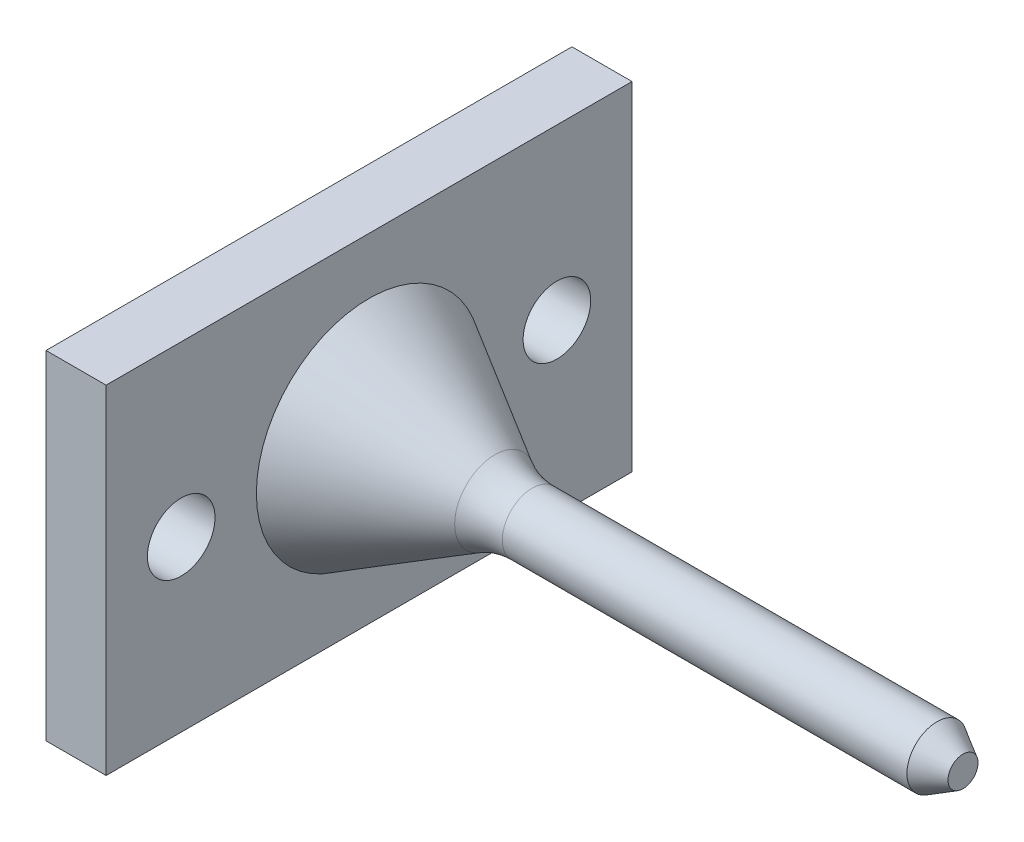
ISO-10303-21;
HEADER;
FILE_DESCRIPTION(('STEP AP214'),'2;1');
FILE_NAME('part.step','',(''),(''),'','','');
FILE_SCHEMA(('AUTOMOTIVE_DESIGN { 1 0 10303 214 1 1 1 1 }'));
ENDSEC;
DATA;
#1=APPLICATION_CONTEXT('core data for automotive mechanical design processes');
#2=APPLICATION_PROTOCOL_DEFINITION('international standard','automotive_design',2000,#1);
#3=PRODUCT_CONTEXT('',#1,'mechanical');
#4=PRODUCT('Part','Part','',(#3));
#5=PRODUCT_RELATED_PRODUCT_CATEGORY('part','',(#4));
#6=PRODUCT_DEFINITION_FORMATION('','',#4);
#7=PRODUCT_DEFINITION_CONTEXT('part definition',#1,'design');
#8=PRODUCT_DEFINITION('design','',#6,#7);
#9=PRODUCT_DEFINITION_SHAPE('','',#8);
#10=(LENGTH_UNIT() NAMED_UNIT(*) SI_UNIT(.MILLI.,.METRE.));
#11=(NAMED_UNIT(*) PLANE_ANGLE_UNIT() SI_UNIT($,.RADIAN.));
#12=(NAMED_UNIT(*) SI_UNIT($,.STERADIAN.) SOLID_ANGLE_UNIT());
#13=UNCERTAINTY_MEASURE_WITH_UNIT(LENGTH_MEASURE(1.E-05),#10,'distance_accuracy_value','');
#14=(GEOMETRIC_REPRESENTATION_CONTEXT(3) GLOBAL_UNCERTAINTY_ASSIGNED_CONTEXT((#13)) GLOBAL_UNIT_ASSIGNED_CONTEXT((#10,
#11,#12)) REPRESENTATION_CONTEXT('',''));
#15=CARTESIAN_POINT('',(0.,0.,0.));
#16=DIRECTION('',(0.,0.,1.));
#17=DIRECTION('',(1.,0.,0.));
#18=AXIS2_PLACEMENT_3D('',#15,#16,#17);
#19=CARTESIAN_POINT('',(16.7320508075687,0.,0.));
#20=DIRECTION('',(-1.,0.,0.));
#21=DIRECTION('',(0.,0.,1.));
#22=AXIS2_PLACEMENT_3D('',#19,#20,#21);
#23=CONICAL_SURFACE('',#22,5.33974596215563,0.523598775598303);
#24=CARTESIAN_POINT('',(0.,0.,0.));
#25=DIRECTION('',(-1.,0.,0.));
#26=DIRECTION('',(0.,0.,1.));
#27=AXIS2_PLACEMENT_3D('',#24,#25,#26);
#28=CIRCLE('',#27,15.);
#29=CARTESIAN_POINT('',(0.,0.,15.));
#30=VERTEX_POINT('',#29);
#31=EDGE_CURVE('E138',#30,#30,#28,.T.);
#32=ORIENTED_EDGE('',*,*,#31,.F.);
#33=EDGE_LOOP('',(#32));
#34=FACE_BOUND('',#33,.T.);
#35=CARTESIAN_POINT('',(16.7320508075687,0.,0.));
#36=DIRECTION('',(-1.,0.,0.));
#37=DIRECTION('',(0.,0.,1.));
#38=AXIS2_PLACEMENT_3D('',#35,#36,#37);
#39=CIRCLE('',#38,5.33974596215563);
#40=CARTESIAN_POINT('',(16.7320508075687,0.,5.33974596215563));
#41=VERTEX_POINT('',#40);
#42=EDGE_CURVE('E134',#41,#41,#39,.T.);
#43=ORIENTED_EDGE('',*,*,#42,.T.);
#44=EDGE_LOOP('',(#43));
#45=FACE_BOUND('',#44,.T.);
#46=ADVANCED_FACE('F39',(#34,#45),#23,.T.);
#47=CARTESIAN_POINT('',(21.7320508075687,0.,0.));
#48=DIRECTION('',(-1.,0.,0.));
#49=DIRECTION('',(0.,0.,1.));
#50=AXIS2_PLACEMENT_3D('',#47,#48,#49);
#51=TOROIDAL_SURFACE('',#50,14.,10.);
#52=ORIENTED_EDGE('',*,*,#42,.F.);
#53=EDGE_LOOP('',(#52));
#54=FACE_BOUND('',#53,.T.);
#55=CARTESIAN_POINT('',(21.7320508075687,0.,0.));
#56=DIRECTION('',(-1.,0.,0.));
#57=DIRECTION('',(0.,0.,1.));
#58=AXIS2_PLACEMENT_3D('',#55,#56,#57);
#59=CIRCLE('',#58,3.99999999999999);
#60=CARTESIAN_POINT('',(21.7320508075687,0.,3.99999999999999));
#61=VERTEX_POINT('',#60);
#62=EDGE_CURVE('E130',#61,#61,#59,.T.);
#63=ORIENTED_EDGE('',*,*,#62,.T.);
#64=EDGE_LOOP('',(#63));
#65=FACE_BOUND('',#64,.T.);
#66=ADVANCED_FACE('F162',(#54,#65),#51,.F.);
#67=CARTESIAN_POINT('',(0.,0.,0.));
#68=DIRECTION('',(-1.,0.,0.));
#69=DIRECTION('',(0.,0.,1.));
#70=AXIS2_PLACEMENT_3D('',#67,#68,#69);
#71=CYLINDRICAL_SURFACE('',#70,4.);
#72=CARTESIAN_POINT('',(75.5884572681197,0.,0.));
#73=DIRECTION('',(-1.,0.,0.));
#74=DIRECTION('',(0.,0.,1.));
#75=AXIS2_PLACEMENT_3D('',#72,#73,#74);
#76=CIRCLE('',#75,4.);
#77=CARTESIAN_POINT('',(75.5884572681197,0.,4.));
#78=VERTEX_POINT('',#77);
#79=EDGE_CURVE('E49',#78,#78,#76,.T.);
#80=ORIENTED_EDGE('',*,*,#79,.T.);
#81=EDGE_LOOP('',(#80));
#82=FACE_BOUND('',#81,.T.);
#83=ORIENTED_EDGE('',*,*,#62,.F.);
#84=EDGE_LOOP('',(#83));
#85=FACE_BOUND('',#84,.T.);
#86=ADVANCED_FACE('F145',(#82,#85),#71,.T.);
#87=CARTESIAN_POINT('',(79.0525588832575,0.,0.));
#88=DIRECTION('',(-1.,0.,0.));
#89=DIRECTION('',(0.,0.,1.));
#90=AXIS2_PLACEMENT_3D('',#87,#88,#89);
#91=PLANE('',#90);
#92=CARTESIAN_POINT('',(79.0525588832575,0.,0.));
#93=DIRECTION('',(-1.,0.,0.));
#94=DIRECTION('',(0.,0.,1.));
#95=AXIS2_PLACEMENT_3D('',#92,#93,#94);
#96=CIRCLE('',#95,1.99999999999999);
#97=CARTESIAN_POINT('',(79.0525588832575,0.,1.99999999999999));
#98=VERTEX_POINT('',#97);
#99=EDGE_CURVE('E11',#98,#98,#96,.F.);
#100=ORIENTED_EDGE('',*,*,#99,.T.);
#101=EDGE_LOOP('',(#100));
#102=FACE_BOUND('',#101,.T.);
#103=ADVANCED_FACE('F149',(#102),#91,.F.);
#104=CARTESIAN_POINT('',(75.5884572681197,0.,0.));
#105=DIRECTION('',(-1.,0.,0.));
#106=DIRECTION('',(0.,0.,1.));
#107=AXIS2_PLACEMENT_3D('',#104,#105,#106);
#108=CONICAL_SURFACE('',#107,4.,0.523598775598302);
#109=ORIENTED_EDGE('',*,*,#99,.F.);
#110=EDGE_LOOP('',(#109));
#111=FACE_BOUND('',#110,.T.);
#112=ORIENTED_EDGE('',*,*,#79,.F.);
#113=EDGE_LOOP('',(#112));
#114=FACE_BOUND('',#113,.T.);
#115=ADVANCED_FACE('F41',(#111,#114),#108,.T.);
#116=CARTESIAN_POINT('',(-8.,0.,0.));
#117=DIRECTION('',(-1.,0.,0.));
#118=DIRECTION('',(0.,0.,1.));
#119=AXIS2_PLACEMENT_3D('',#116,#117,#118);
#120=PLANE('',#119);
#121=CARTESIAN_POINT('',(-8.,0.,-25.));
#122=DIRECTION('',(-1.,0.,0.));
#123=DIRECTION('',(0.,0.,1.));
#124=AXIS2_PLACEMENT_3D('',#121,#122,#123);
#125=CIRCLE('',#124,4.5);
#126=CARTESIAN_POINT('',(-8.,0.,-20.5));
#127=VERTEX_POINT('',#126);
#128=EDGE_CURVE('E117',#127,#127,#125,.T.);
#129=ORIENTED_EDGE('',*,*,#128,.F.);
#130=EDGE_LOOP('',(#129));
#131=FACE_BOUND('',#130,.T.);
#132=DIRECTION('',(0.,-1.,0.));
#133=VECTOR('',#132,1.);
#134=CARTESIAN_POINT('',(-8.,22.5,-35.));
#135=LINE('',#134,#133);
#136=CARTESIAN_POINT('',(-8.,22.5,-35.));
#137=VERTEX_POINT('',#136);
#138=CARTESIAN_POINT('',(-8.,-22.5,-35.));
#139=VERTEX_POINT('',#138);
#140=EDGE_CURVE('E94',#137,#139,#135,.T.);
#141=ORIENTED_EDGE('',*,*,#140,.T.);
#142=DIRECTION('',(0.,0.,1.));
#143=VECTOR('',#142,1.);
#144=CARTESIAN_POINT('',(-8.,-22.5,-35.));
#145=LINE('',#144,#143);
#146=CARTESIAN_POINT('',(-8.,-22.5,35.));
#147=VERTEX_POINT('',#146);
#148=EDGE_CURVE('E88',#139,#147,#145,.T.);
#149=ORIENTED_EDGE('',*,*,#148,.T.);
#150=DIRECTION('',(0.,1.,0.));
#151=VECTOR('',#150,1.);
#152=CARTESIAN_POINT('',(-8.,22.5,35.));
#153=LINE('',#152,#151);
#154=CARTESIAN_POINT('',(-8.,22.5,35.));
#155=VERTEX_POINT('',#154);
#156=EDGE_CURVE('E92',#147,#155,#153,.T.);
#157=ORIENTED_EDGE('',*,*,#156,.T.);
#158=DIRECTION('',(0.,0.,-1.));
#159=VECTOR('',#158,1.);
#160=CARTESIAN_POINT('',(-8.,22.5,-35.));
#161=LINE('',#160,#159);
#162=EDGE_CURVE('E57',#155,#137,#161,.T.);
#163=ORIENTED_EDGE('',*,*,#162,.T.);
#164=EDGE_LOOP('',(#141,#149,#157,#163));
#165=FACE_BOUND('',#164,.T.);
#166=CARTESIAN_POINT('',(-8.,0.,25.));
#167=DIRECTION('',(-1.,0.,0.));
#168=DIRECTION('',(0.,0.,1.));
#169=AXIS2_PLACEMENT_3D('',#166,#167,#168);
#170=CIRCLE('',#169,4.5);
#171=CARTESIAN_POINT('',(-8.,0.,29.5));
#172=VERTEX_POINT('',#171);
#173=EDGE_CURVE('E200',#172,#172,#170,.T.);
#174=ORIENTED_EDGE('',*,*,#173,.F.);
#175=EDGE_LOOP('',(#174));
#176=FACE_BOUND('',#175,.T.);
#177=ADVANCED_FACE('F89',(#131,#165,#176),#120,.T.);
#178=CARTESIAN_POINT('',(0.,0.,0.));
#179=DIRECTION('',(-1.,0.,0.));
#180=DIRECTION('',(0.,0.,1.));
#181=AXIS2_PLACEMENT_3D('',#178,#179,#180);
#182=PLANE('',#181);
#183=ORIENTED_EDGE('',*,*,#31,.T.);
#184=EDGE_LOOP('',(#183));
#185=FACE_BOUND('',#184,.T.);
#186=DIRECTION('',(0.,-1.,0.));
#187=VECTOR('',#186,1.);
#188=CARTESIAN_POINT('',(0.,22.5,-35.));
#189=LINE('',#188,#187);
#190=CARTESIAN_POINT('',(0.,22.5,-35.));
#191=VERTEX_POINT('',#190);
#192=CARTESIAN_POINT('',(0.,-22.5,-35.));
#193=VERTEX_POINT('',#192);
#194=EDGE_CURVE('E113',#191,#193,#189,.T.);
#195=ORIENTED_EDGE('',*,*,#194,.F.);
#196=DIRECTION('',(0.,0.,-1.));
#197=VECTOR('',#196,1.);
#198=CARTESIAN_POINT('',(0.,22.5,-35.));
#199=LINE('',#198,#197);
#200=CARTESIAN_POINT('',(0.,22.5,35.));
#201=VERTEX_POINT('',#200);
#202=EDGE_CURVE('E80',#201,#191,#199,.T.);
#203=ORIENTED_EDGE('',*,*,#202,.F.);
#204=DIRECTION('',(0.,1.,0.));
#205=VECTOR('',#204,1.);
#206=CARTESIAN_POINT('',(0.,22.5,35.));
#207=LINE('',#206,#205);
#208=CARTESIAN_POINT('',(0.,-22.5,35.));
#209=VERTEX_POINT('',#208);
#210=EDGE_CURVE('E74',#209,#201,#207,.T.);
#211=ORIENTED_EDGE('',*,*,#210,.F.);
#212=DIRECTION('',(0.,0.,1.));
#213=VECTOR('',#212,1.);
#214=CARTESIAN_POINT('',(0.,-22.5,-35.));
#215=LINE('',#214,#213);
#216=EDGE_CURVE('E100',#193,#209,#215,.T.);
#217=ORIENTED_EDGE('',*,*,#216,.F.);
#218=EDGE_LOOP('',(#195,#203,#211,#217));
#219=FACE_BOUND('',#218,.T.);
#220=CARTESIAN_POINT('',(0.,0.,-25.));
#221=DIRECTION('',(-1.,0.,0.));
#222=DIRECTION('',(0.,0.,1.));
#223=AXIS2_PLACEMENT_3D('',#220,#221,#222);
#224=CIRCLE('',#223,4.5);
#225=CARTESIAN_POINT('',(0.,0.,-20.5));
#226=VERTEX_POINT('',#225);
#227=EDGE_CURVE('E208',#226,#226,#224,.T.);
#228=ORIENTED_EDGE('',*,*,#227,.T.);
#229=EDGE_LOOP('',(#228));
#230=FACE_BOUND('',#229,.T.);
#231=CARTESIAN_POINT('',(0.,0.,25.));
#232=DIRECTION('',(-1.,0.,0.));
#233=DIRECTION('',(0.,0.,1.));
#234=AXIS2_PLACEMENT_3D('',#231,#232,#233);
#235=CIRCLE('',#234,4.5);
#236=CARTESIAN_POINT('',(0.,0.,29.5));
#237=VERTEX_POINT('',#236);
#238=EDGE_CURVE('E203',#237,#237,#235,.T.);
#239=ORIENTED_EDGE('',*,*,#238,.T.);
#240=EDGE_LOOP('',(#239));
#241=FACE_BOUND('',#240,.T.);
#242=ADVANCED_FACE('F155',(#185,#219,#230,#241),#182,.F.);
#243=CARTESIAN_POINT('',(-8.,22.5,-35.));
#244=DIRECTION('',(0.,0.,1.));
#245=DIRECTION('',(1.,0.,0.));
#246=AXIS2_PLACEMENT_3D('',#243,#244,#245);
#247=PLANE('',#246);
#248=ORIENTED_EDGE('',*,*,#194,.T.);
#249=DIRECTION('',(1.,0.,0.));
#250=VECTOR('',#249,1.);
#251=CARTESIAN_POINT('',(-8.,-22.5,-35.));
#252=LINE('',#251,#250);
#253=EDGE_CURVE('E102',#139,#193,#252,.T.);
#254=ORIENTED_EDGE('',*,*,#253,.F.);
#255=ORIENTED_EDGE('',*,*,#140,.F.);
#256=DIRECTION('',(1.,0.,0.));
#257=VECTOR('',#256,1.);
#258=CARTESIAN_POINT('',(-8.,22.5,-35.));
#259=LINE('',#258,#257);
#260=EDGE_CURVE('E109',#137,#191,#259,.T.);
#261=ORIENTED_EDGE('',*,*,#260,.T.);
#262=EDGE_LOOP('',(#248,#254,#255,#261));
#263=FACE_BOUND('',#262,.T.);
#264=ADVANCED_FACE('F174',(#263),#247,.F.);
#265=CARTESIAN_POINT('',(-8.,-22.5,-35.));
#266=DIRECTION('',(0.,1.,0.));
#267=DIRECTION('',(0.,0.,1.));
#268=AXIS2_PLACEMENT_3D('',#265,#266,#267);
#269=PLANE('',#268);
#270=ORIENTED_EDGE('',*,*,#216,.T.);
#271=DIRECTION('',(1.,0.,0.));
#272=VECTOR('',#271,1.);
#273=CARTESIAN_POINT('',(-8.,-22.5,35.));
#274=LINE('',#273,#272);
#275=EDGE_CURVE('E98',#147,#209,#274,.T.);
#276=ORIENTED_EDGE('',*,*,#275,.F.);
#277=ORIENTED_EDGE('',*,*,#148,.F.);
#278=ORIENTED_EDGE('',*,*,#253,.T.);
#279=EDGE_LOOP('',(#270,#276,#277,#278));
#280=FACE_BOUND('',#279,.T.);
#281=ADVANCED_FACE('F99',(#280),#269,.F.);
#282=CARTESIAN_POINT('',(-8.,22.5,35.));
#283=DIRECTION('',(0.,0.,-1.));
#284=DIRECTION('',(-1.,0.,0.));
#285=AXIS2_PLACEMENT_3D('',#282,#283,#284);
#286=PLANE('',#285);
#287=ORIENTED_EDGE('',*,*,#210,.T.);
#288=DIRECTION('',(1.,0.,0.));
#289=VECTOR('',#288,1.);
#290=CARTESIAN_POINT('',(-8.,22.5,35.));
#291=LINE('',#290,#289);
#292=EDGE_CURVE('E103',#155,#201,#291,.T.);
#293=ORIENTED_EDGE('',*,*,#292,.F.);
#294=ORIENTED_EDGE('',*,*,#156,.F.);
#295=ORIENTED_EDGE('',*,*,#275,.T.);
#296=EDGE_LOOP('',(#287,#293,#294,#295));
#297=FACE_BOUND('',#296,.T.);
#298=ADVANCED_FACE('F105',(#297),#286,.F.);
#299=CARTESIAN_POINT('',(-8.,22.5,-35.));
#300=DIRECTION('',(0.,-1.,0.));
#301=DIRECTION('',(0.,0.,-1.));
#302=AXIS2_PLACEMENT_3D('',#299,#300,#301);
#303=PLANE('',#302);
#304=ORIENTED_EDGE('',*,*,#202,.T.);
#305=ORIENTED_EDGE('',*,*,#260,.F.);
#306=ORIENTED_EDGE('',*,*,#162,.F.);
#307=ORIENTED_EDGE('',*,*,#292,.T.);
#308=EDGE_LOOP('',(#304,#305,#306,#307));
#309=FACE_BOUND('',#308,.T.);
#310=ADVANCED_FACE('F182',(#309),#303,.F.);
#311=CARTESIAN_POINT('',(-8.,0.,-25.));
#312=DIRECTION('',(1.,0.,0.));
#313=DIRECTION('',(0.,0.,-1.));
#314=AXIS2_PLACEMENT_3D('',#311,#312,#313);
#315=CYLINDRICAL_SURFACE('',#314,4.5);
#316=ORIENTED_EDGE('',*,*,#128,.T.);
#317=EDGE_LOOP('',(#316));
#318=FACE_BOUND('',#317,.T.);
#319=ORIENTED_EDGE('',*,*,#227,.F.);
#320=EDGE_LOOP('',(#319));
#321=FACE_BOUND('',#320,.T.);
#322=ADVANCED_FACE('F185',(#318,#321),#315,.F.);
#323=CARTESIAN_POINT('',(-8.,0.,25.));
#324=DIRECTION('',(1.,0.,0.));
#325=DIRECTION('',(0.,0.,-1.));
#326=AXIS2_PLACEMENT_3D('',#323,#324,#325);
#327=CYLINDRICAL_SURFACE('',#326,4.5);
#328=ORIENTED_EDGE('',*,*,#173,.T.);
#329=EDGE_LOOP('',(#328));
#330=FACE_BOUND('',#329,.T.);
#331=ORIENTED_EDGE('',*,*,#238,.F.);
#332=EDGE_LOOP('',(#331));
#333=FACE_BOUND('',#332,.T.);
#334=ADVANCED_FACE('F191',(#330,#333),#327,.F.);
#335=CLOSED_SHELL('',(#46,#66,#86,#103,#115,#177,#242,#264,#281,#298,#310,#322,#334));
#336=MANIFOLD_SOLID_BREP('B2',#335);
#337=ADVANCED_BREP_SHAPE_REPRESENTATION('',(#18,#336),#14);
#338=SHAPE_DEFINITION_REPRESENTATION(#9,#337);
ENDSEC;
END-ISO-10303-21;
